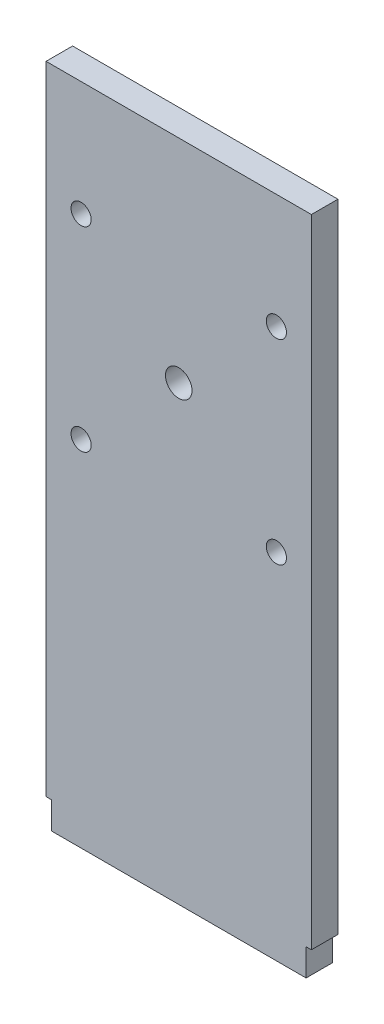
ISO-10303-21;
HEADER;
FILE_DESCRIPTION(('STEP AP214'),'2;1');
FILE_NAME('part.step','',(''),(''),'','','');
FILE_SCHEMA(('AUTOMOTIVE_DESIGN { 1 0 10303 214 1 1 1 1 }'));
ENDSEC;
DATA;
#1=APPLICATION_CONTEXT('core data for automotive mechanical design processes');
#2=APPLICATION_PROTOCOL_DEFINITION('international standard','automotive_design',2000,#1);
#3=PRODUCT_CONTEXT('',#1,'mechanical');
#4=PRODUCT('Part','Part','',(#3));
#5=PRODUCT_RELATED_PRODUCT_CATEGORY('part','',(#4));
#6=PRODUCT_DEFINITION_FORMATION('','',#4);
#7=PRODUCT_DEFINITION_CONTEXT('part definition',#1,'design');
#8=PRODUCT_DEFINITION('design','',#6,#7);
#9=PRODUCT_DEFINITION_SHAPE('','',#8);
#10=(LENGTH_UNIT() NAMED_UNIT(*) SI_UNIT(.MILLI.,.METRE.));
#11=(NAMED_UNIT(*) PLANE_ANGLE_UNIT() SI_UNIT($,.RADIAN.));
#12=(NAMED_UNIT(*) SI_UNIT($,.STERADIAN.) SOLID_ANGLE_UNIT());
#13=UNCERTAINTY_MEASURE_WITH_UNIT(LENGTH_MEASURE(1.E-05),#10,'distance_accuracy_value','');
#14=(GEOMETRIC_REPRESENTATION_CONTEXT(3) GLOBAL_UNCERTAINTY_ASSIGNED_CONTEXT((#13)) GLOBAL_UNIT_ASSIGNED_CONTEXT((#10,
#11,#12)) REPRESENTATION_CONTEXT('',''));
#15=CARTESIAN_POINT('',(0.,0.,0.));
#16=DIRECTION('',(0.,0.,1.));
#17=DIRECTION('',(1.,0.,0.));
#18=AXIS2_PLACEMENT_3D('',#15,#16,#17);
#19=CARTESIAN_POINT('',(0.,0.,6.35));
#20=DIRECTION('',(0.,0.,-1.));
#21=DIRECTION('',(-1.,0.,0.));
#22=AXIS2_PLACEMENT_3D('',#19,#20,#21);
#23=PLANE('',#22);
#24=CARTESIAN_POINT('',(8.38200000000009,84.7090000000001,6.35));
#25=DIRECTION('',(0.,0.,1.));
#26=DIRECTION('',(-1.,0.,0.));
#27=AXIS2_PLACEMENT_3D('',#24,#25,#26);
#28=CIRCLE('',#27,2.413);
#29=CARTESIAN_POINT('',(5.96900000000009,84.7090000000001,6.35));
#30=VERTEX_POINT('',#29);
#31=EDGE_CURVE('E148',#30,#30,#28,.T.);
#32=ORIENTED_EDGE('',*,*,#31,.F.);
#33=EDGE_LOOP('',(#32));
#34=FACE_BOUND('',#33,.T.);
#35=CARTESIAN_POINT('',(55.1179999999999,131.445,6.35));
#36=DIRECTION('',(0.,0.,1.));
#37=DIRECTION('',(-1.,0.,0.));
#38=AXIS2_PLACEMENT_3D('',#35,#36,#37);
#39=CIRCLE('',#38,2.41300000000001);
#40=CARTESIAN_POINT('',(52.7049999999999,131.445,6.35));
#41=VERTEX_POINT('',#40);
#42=EDGE_CURVE('E160',#41,#41,#39,.T.);
#43=ORIENTED_EDGE('',*,*,#42,.F.);
#44=EDGE_LOOP('',(#43));
#45=FACE_BOUND('',#44,.T.);
#46=DIRECTION('',(1.,0.,0.));
#47=VECTOR('',#46,1.);
#48=CARTESIAN_POINT('',(0.,0.,6.35));
#49=LINE('',#48,#47);
#50=CARTESIAN_POINT('',(1.27000000000001,0.,6.35));
#51=VERTEX_POINT('',#50);
#52=CARTESIAN_POINT('',(62.23,0.,6.35));
#53=VERTEX_POINT('',#52);
#54=EDGE_CURVE('E175',#51,#53,#49,.T.);
#55=ORIENTED_EDGE('',*,*,#54,.T.);
#56=DIRECTION('',(0.,-1.,0.));
#57=VECTOR('',#56,1.);
#58=CARTESIAN_POINT('',(62.23,0.,6.35));
#59=LINE('',#58,#57);
#60=CARTESIAN_POINT('',(62.23,6.477,6.35));
#61=VERTEX_POINT('',#60);
#62=EDGE_CURVE('E118',#61,#53,#59,.T.);
#63=ORIENTED_EDGE('',*,*,#62,.F.);
#64=DIRECTION('',(-1.,0.,0.));
#65=VECTOR('',#64,1.);
#66=CARTESIAN_POINT('',(63.5,6.477,6.35));
#67=LINE('',#66,#65);
#68=CARTESIAN_POINT('',(63.5,6.477,6.35));
#69=VERTEX_POINT('',#68);
#70=EDGE_CURVE('E99',#69,#61,#67,.T.);
#71=ORIENTED_EDGE('',*,*,#70,.F.);
#72=DIRECTION('',(0.,1.,0.));
#73=VECTOR('',#72,1.);
#74=CARTESIAN_POINT('',(63.5,0.,6.35));
#75=LINE('',#74,#73);
#76=CARTESIAN_POINT('',(63.5,158.877,6.35));
#77=VERTEX_POINT('',#76);
#78=EDGE_CURVE('E179',#69,#77,#75,.T.);
#79=ORIENTED_EDGE('',*,*,#78,.T.);
#80=DIRECTION('',(-1.,0.,0.));
#81=VECTOR('',#80,1.);
#82=CARTESIAN_POINT('',(0.,158.877,6.35));
#83=LINE('',#82,#81);
#84=CARTESIAN_POINT('',(0.,158.877,6.35));
#85=VERTEX_POINT('',#84);
#86=EDGE_CURVE('E181',#77,#85,#83,.T.);
#87=ORIENTED_EDGE('',*,*,#86,.T.);
#88=DIRECTION('',(0.,-1.,0.));
#89=VECTOR('',#88,1.);
#90=CARTESIAN_POINT('',(0.,0.,6.35));
#91=LINE('',#90,#89);
#92=CARTESIAN_POINT('',(0.,6.477,6.35));
#93=VERTEX_POINT('',#92);
#94=EDGE_CURVE('E172',#85,#93,#91,.T.);
#95=ORIENTED_EDGE('',*,*,#94,.T.);
#96=DIRECTION('',(-1.,0.,0.));
#97=VECTOR('',#96,1.);
#98=CARTESIAN_POINT('',(0.,6.477,6.35));
#99=LINE('',#98,#97);
#100=CARTESIAN_POINT('',(1.27000000000001,6.477,6.35));
#101=VERTEX_POINT('',#100);
#102=EDGE_CURVE('E128',#101,#93,#99,.T.);
#103=ORIENTED_EDGE('',*,*,#102,.F.);
#104=DIRECTION('',(0.,1.,0.));
#105=VECTOR('',#104,1.);
#106=CARTESIAN_POINT('',(1.27000000000001,0.,6.35));
#107=LINE('',#106,#105);
#108=EDGE_CURVE('E123',#51,#101,#107,.T.);
#109=ORIENTED_EDGE('',*,*,#108,.F.);
#110=EDGE_LOOP('',(#55,#63,#71,#79,#87,#95,#103,#109));
#111=FACE_BOUND('',#110,.T.);
#112=CARTESIAN_POINT('',(8.38200000000008,131.445,6.35));
#113=DIRECTION('',(0.,0.,1.));
#114=DIRECTION('',(1.,0.,0.));
#115=AXIS2_PLACEMENT_3D('',#112,#113,#114);
#116=CIRCLE('',#115,2.41300000000002);
#117=CARTESIAN_POINT('',(10.7950000000001,131.445,6.35));
#118=VERTEX_POINT('',#117);
#119=EDGE_CURVE('E166',#118,#118,#116,.T.);
#120=ORIENTED_EDGE('',*,*,#119,.F.);
#121=EDGE_LOOP('',(#120));
#122=FACE_BOUND('',#121,.T.);
#123=CARTESIAN_POINT('',(55.1179999999999,84.7090000000001,6.35));
#124=DIRECTION('',(0.,0.,1.));
#125=DIRECTION('',(1.,0.,0.));
#126=AXIS2_PLACEMENT_3D('',#123,#124,#125);
#127=CIRCLE('',#126,2.41299999999999);
#128=CARTESIAN_POINT('',(57.5309999999999,84.7090000000001,6.35));
#129=VERTEX_POINT('',#128);
#130=EDGE_CURVE('E154',#129,#129,#127,.T.);
#131=ORIENTED_EDGE('',*,*,#130,.F.);
#132=EDGE_LOOP('',(#131));
#133=FACE_BOUND('',#132,.T.);
#134=CARTESIAN_POINT('',(31.75,108.077,6.35));
#135=DIRECTION('',(0.,0.,1.));
#136=DIRECTION('',(1.,0.,0.));
#137=AXIS2_PLACEMENT_3D('',#134,#135,#136);
#138=CIRCLE('',#137,3.175);
#139=CARTESIAN_POINT('',(34.925,108.077,6.35));
#140=VERTEX_POINT('',#139);
#141=EDGE_CURVE('E142',#140,#140,#138,.T.);
#142=ORIENTED_EDGE('',*,*,#141,.F.);
#143=EDGE_LOOP('',(#142));
#144=FACE_BOUND('',#143,.T.);
#145=ADVANCED_FACE('F32',(#34,#45,#111,#122,#133,#144),#23,.F.);
#146=CARTESIAN_POINT('',(0.,0.,0.));
#147=DIRECTION('',(0.,0.,-1.));
#148=DIRECTION('',(-1.,0.,0.));
#149=AXIS2_PLACEMENT_3D('',#146,#147,#148);
#150=PLANE('',#149);
#151=DIRECTION('',(0.,-1.,0.));
#152=VECTOR('',#151,1.);
#153=CARTESIAN_POINT('',(62.23,0.,0.));
#154=LINE('',#153,#152);
#155=CARTESIAN_POINT('',(62.23,6.477,0.));
#156=VERTEX_POINT('',#155);
#157=CARTESIAN_POINT('',(62.23,0.,0.));
#158=VERTEX_POINT('',#157);
#159=EDGE_CURVE('E106',#156,#158,#154,.T.);
#160=ORIENTED_EDGE('',*,*,#159,.T.);
#161=DIRECTION('',(1.,0.,0.));
#162=VECTOR('',#161,1.);
#163=CARTESIAN_POINT('',(0.,0.,0.));
#164=LINE('',#163,#162);
#165=CARTESIAN_POINT('',(1.27000000000001,0.,0.));
#166=VERTEX_POINT('',#165);
#167=EDGE_CURVE('E185',#166,#158,#164,.T.);
#168=ORIENTED_EDGE('',*,*,#167,.F.);
#169=DIRECTION('',(0.,1.,0.));
#170=VECTOR('',#169,1.);
#171=CARTESIAN_POINT('',(1.27000000000001,0.,0.));
#172=LINE('',#171,#170);
#173=CARTESIAN_POINT('',(1.27000000000001,6.477,0.));
#174=VERTEX_POINT('',#173);
#175=EDGE_CURVE('E55',#166,#174,#172,.T.);
#176=ORIENTED_EDGE('',*,*,#175,.T.);
#177=DIRECTION('',(-1.,0.,0.));
#178=VECTOR('',#177,1.);
#179=CARTESIAN_POINT('',(0.,6.477,0.));
#180=LINE('',#179,#178);
#181=CARTESIAN_POINT('',(0.,6.477,0.));
#182=VERTEX_POINT('',#181);
#183=EDGE_CURVE('E127',#174,#182,#180,.T.);
#184=ORIENTED_EDGE('',*,*,#183,.T.);
#185=DIRECTION('',(0.,-1.,0.));
#186=VECTOR('',#185,1.);
#187=CARTESIAN_POINT('',(0.,0.,0.));
#188=LINE('',#187,#186);
#189=CARTESIAN_POINT('',(0.,158.877,0.));
#190=VERTEX_POINT('',#189);
#191=EDGE_CURVE('E169',#190,#182,#188,.T.);
#192=ORIENTED_EDGE('',*,*,#191,.F.);
#193=DIRECTION('',(-1.,0.,0.));
#194=VECTOR('',#193,1.);
#195=CARTESIAN_POINT('',(0.,158.877,0.));
#196=LINE('',#195,#194);
#197=CARTESIAN_POINT('',(63.5,158.877,0.));
#198=VERTEX_POINT('',#197);
#199=EDGE_CURVE('E176',#198,#190,#196,.T.);
#200=ORIENTED_EDGE('',*,*,#199,.F.);
#201=DIRECTION('',(0.,1.,0.));
#202=VECTOR('',#201,1.);
#203=CARTESIAN_POINT('',(63.5,0.,0.));
#204=LINE('',#203,#202);
#205=CARTESIAN_POINT('',(63.5,6.477,0.));
#206=VERTEX_POINT('',#205);
#207=EDGE_CURVE('E117',#206,#198,#204,.T.);
#208=ORIENTED_EDGE('',*,*,#207,.F.);
#209=DIRECTION('',(-1.,0.,0.));
#210=VECTOR('',#209,1.);
#211=CARTESIAN_POINT('',(63.5,6.477,0.));
#212=LINE('',#211,#210);
#213=EDGE_CURVE('E47',#206,#156,#212,.T.);
#214=ORIENTED_EDGE('',*,*,#213,.T.);
#215=EDGE_LOOP('',(#160,#168,#176,#184,#192,#200,#208,#214));
#216=FACE_BOUND('',#215,.T.);
#217=CARTESIAN_POINT('',(8.38200000000009,84.7090000000001,0.));
#218=DIRECTION('',(0.,0.,1.));
#219=DIRECTION('',(-1.,0.,0.));
#220=AXIS2_PLACEMENT_3D('',#217,#218,#219);
#221=CIRCLE('',#220,2.413);
#222=CARTESIAN_POINT('',(5.96900000000009,84.7090000000001,0.));
#223=VERTEX_POINT('',#222);
#224=EDGE_CURVE('E145',#223,#223,#221,.T.);
#225=ORIENTED_EDGE('',*,*,#224,.T.);
#226=EDGE_LOOP('',(#225));
#227=FACE_BOUND('',#226,.T.);
#228=CARTESIAN_POINT('',(55.1179999999999,131.445,0.));
#229=DIRECTION('',(0.,0.,1.));
#230=DIRECTION('',(-1.,0.,0.));
#231=AXIS2_PLACEMENT_3D('',#228,#229,#230);
#232=CIRCLE('',#231,2.41300000000001);
#233=CARTESIAN_POINT('',(52.7049999999999,131.445,0.));
#234=VERTEX_POINT('',#233);
#235=EDGE_CURVE('E157',#234,#234,#232,.T.);
#236=ORIENTED_EDGE('',*,*,#235,.T.);
#237=EDGE_LOOP('',(#236));
#238=FACE_BOUND('',#237,.T.);
#239=CARTESIAN_POINT('',(8.38200000000008,131.445,0.));
#240=DIRECTION('',(0.,0.,1.));
#241=DIRECTION('',(1.,0.,0.));
#242=AXIS2_PLACEMENT_3D('',#239,#240,#241);
#243=CIRCLE('',#242,2.41300000000002);
#244=CARTESIAN_POINT('',(10.7950000000001,131.445,0.));
#245=VERTEX_POINT('',#244);
#246=EDGE_CURVE('E163',#245,#245,#243,.T.);
#247=ORIENTED_EDGE('',*,*,#246,.T.);
#248=EDGE_LOOP('',(#247));
#249=FACE_BOUND('',#248,.T.);
#250=CARTESIAN_POINT('',(55.1179999999999,84.7090000000001,0.));
#251=DIRECTION('',(0.,0.,1.));
#252=DIRECTION('',(1.,0.,0.));
#253=AXIS2_PLACEMENT_3D('',#250,#251,#252);
#254=CIRCLE('',#253,2.41299999999999);
#255=CARTESIAN_POINT('',(57.5309999999999,84.7090000000001,0.));
#256=VERTEX_POINT('',#255);
#257=EDGE_CURVE('E151',#256,#256,#254,.T.);
#258=ORIENTED_EDGE('',*,*,#257,.T.);
#259=EDGE_LOOP('',(#258));
#260=FACE_BOUND('',#259,.T.);
#261=CARTESIAN_POINT('',(31.75,108.077,0.));
#262=DIRECTION('',(0.,0.,1.));
#263=DIRECTION('',(1.,0.,0.));
#264=AXIS2_PLACEMENT_3D('',#261,#262,#263);
#265=CIRCLE('',#264,3.175);
#266=CARTESIAN_POINT('',(34.925,108.077,0.));
#267=VERTEX_POINT('',#266);
#268=EDGE_CURVE('E138',#267,#267,#265,.T.);
#269=ORIENTED_EDGE('',*,*,#268,.T.);
#270=EDGE_LOOP('',(#269));
#271=FACE_BOUND('',#270,.T.);
#272=ADVANCED_FACE('F114',(#216,#227,#238,#249,#260,#271),#150,.T.);
#273=CARTESIAN_POINT('',(0.,0.,6.35));
#274=DIRECTION('',(1.,0.,0.));
#275=DIRECTION('',(0.,0.,-1.));
#276=AXIS2_PLACEMENT_3D('',#273,#274,#275);
#277=PLANE('',#276);
#278=ORIENTED_EDGE('',*,*,#191,.T.);
#279=DIRECTION('',(0.,0.,1.));
#280=VECTOR('',#279,1.);
#281=CARTESIAN_POINT('',(0.,6.477,0.));
#282=LINE('',#281,#280);
#283=EDGE_CURVE('E135',#182,#93,#282,.T.);
#284=ORIENTED_EDGE('',*,*,#283,.T.);
#285=ORIENTED_EDGE('',*,*,#94,.F.);
#286=DIRECTION('',(0.,0.,-1.));
#287=VECTOR('',#286,1.);
#288=CARTESIAN_POINT('',(0.,158.877,6.35));
#289=LINE('',#288,#287);
#290=EDGE_CURVE('E40',#85,#190,#289,.T.);
#291=ORIENTED_EDGE('',*,*,#290,.T.);
#292=EDGE_LOOP('',(#278,#284,#285,#291));
#293=FACE_BOUND('',#292,.T.);
#294=ADVANCED_FACE('F34',(#293),#277,.F.);
#295=CARTESIAN_POINT('',(0.,0.,6.35));
#296=DIRECTION('',(0.,1.,0.));
#297=DIRECTION('',(0.,0.,1.));
#298=AXIS2_PLACEMENT_3D('',#295,#296,#297);
#299=PLANE('',#298);
#300=ORIENTED_EDGE('',*,*,#167,.T.);
#301=DIRECTION('',(0.,0.,1.));
#302=VECTOR('',#301,1.);
#303=CARTESIAN_POINT('',(62.23,0.,0.));
#304=LINE('',#303,#302);
#305=EDGE_CURVE('E102',#158,#53,#304,.T.);
#306=ORIENTED_EDGE('',*,*,#305,.T.);
#307=ORIENTED_EDGE('',*,*,#54,.F.);
#308=DIRECTION('',(0.,0.,1.));
#309=VECTOR('',#308,1.);
#310=CARTESIAN_POINT('',(1.27000000000001,0.,0.));
#311=LINE('',#310,#309);
#312=EDGE_CURVE('E131',#166,#51,#311,.T.);
#313=ORIENTED_EDGE('',*,*,#312,.F.);
#314=EDGE_LOOP('',(#300,#306,#307,#313));
#315=FACE_BOUND('',#314,.T.);
#316=ADVANCED_FACE('F209',(#315),#299,.F.);
#317=CARTESIAN_POINT('',(63.5,0.,6.35));
#318=DIRECTION('',(-1.,0.,0.));
#319=DIRECTION('',(0.,-1.,0.));
#320=AXIS2_PLACEMENT_3D('',#317,#318,#319);
#321=PLANE('',#320);
#322=ORIENTED_EDGE('',*,*,#78,.F.);
#323=DIRECTION('',(0.,0.,1.));
#324=VECTOR('',#323,1.);
#325=CARTESIAN_POINT('',(63.5,6.477,0.));
#326=LINE('',#325,#324);
#327=EDGE_CURVE('E103',#206,#69,#326,.T.);
#328=ORIENTED_EDGE('',*,*,#327,.F.);
#329=ORIENTED_EDGE('',*,*,#207,.T.);
#330=DIRECTION('',(0.,0.,-1.));
#331=VECTOR('',#330,1.);
#332=CARTESIAN_POINT('',(63.5,158.877,6.35));
#333=LINE('',#332,#331);
#334=EDGE_CURVE('E11',#77,#198,#333,.T.);
#335=ORIENTED_EDGE('',*,*,#334,.F.);
#336=EDGE_LOOP('',(#322,#328,#329,#335));
#337=FACE_BOUND('',#336,.T.);
#338=ADVANCED_FACE('F206',(#337),#321,.F.);
#339=CARTESIAN_POINT('',(0.,158.877,6.35));
#340=DIRECTION('',(0.,-1.,0.));
#341=DIRECTION('',(0.,0.,-1.));
#342=AXIS2_PLACEMENT_3D('',#339,#340,#341);
#343=PLANE('',#342);
#344=ORIENTED_EDGE('',*,*,#199,.T.);
#345=ORIENTED_EDGE('',*,*,#290,.F.);
#346=ORIENTED_EDGE('',*,*,#86,.F.);
#347=ORIENTED_EDGE('',*,*,#334,.T.);
#348=EDGE_LOOP('',(#344,#345,#346,#347));
#349=FACE_BOUND('',#348,.T.);
#350=ADVANCED_FACE('F204',(#349),#343,.F.);
#351=CARTESIAN_POINT('',(8.38200000000008,131.445,6.35));
#352=DIRECTION('',(0.,0.,-1.));
#353=DIRECTION('',(-1.,0.,0.));
#354=AXIS2_PLACEMENT_3D('',#351,#352,#353);
#355=CYLINDRICAL_SURFACE('',#354,2.41300000000002);
#356=ORIENTED_EDGE('',*,*,#119,.T.);
#357=EDGE_LOOP('',(#356));
#358=FACE_BOUND('',#357,.T.);
#359=ORIENTED_EDGE('',*,*,#246,.F.);
#360=EDGE_LOOP('',(#359));
#361=FACE_BOUND('',#360,.T.);
#362=ADVANCED_FACE('F231',(#358,#361),#355,.F.);
#363=CARTESIAN_POINT('',(55.1179999999999,131.445,6.35));
#364=DIRECTION('',(0.,0.,-1.));
#365=DIRECTION('',(-1.,0.,0.));
#366=AXIS2_PLACEMENT_3D('',#363,#364,#365);
#367=CYLINDRICAL_SURFACE('',#366,2.41300000000001);
#368=ORIENTED_EDGE('',*,*,#42,.T.);
#369=EDGE_LOOP('',(#368));
#370=FACE_BOUND('',#369,.T.);
#371=ORIENTED_EDGE('',*,*,#235,.F.);
#372=EDGE_LOOP('',(#371));
#373=FACE_BOUND('',#372,.T.);
#374=ADVANCED_FACE('F280',(#370,#373),#367,.F.);
#375=CARTESIAN_POINT('',(55.1179999999999,84.7090000000001,6.35));
#376=DIRECTION('',(0.,0.,-1.));
#377=DIRECTION('',(-1.,0.,0.));
#378=AXIS2_PLACEMENT_3D('',#375,#376,#377);
#379=CYLINDRICAL_SURFACE('',#378,2.41299999999999);
#380=ORIENTED_EDGE('',*,*,#130,.T.);
#381=EDGE_LOOP('',(#380));
#382=FACE_BOUND('',#381,.T.);
#383=ORIENTED_EDGE('',*,*,#257,.F.);
#384=EDGE_LOOP('',(#383));
#385=FACE_BOUND('',#384,.T.);
#386=ADVANCED_FACE('F270',(#382,#385),#379,.F.);
#387=CARTESIAN_POINT('',(8.38200000000009,84.7090000000001,6.35));
#388=DIRECTION('',(0.,0.,-1.));
#389=DIRECTION('',(-1.,0.,0.));
#390=AXIS2_PLACEMENT_3D('',#387,#388,#389);
#391=CYLINDRICAL_SURFACE('',#390,2.413);
#392=ORIENTED_EDGE('',*,*,#31,.T.);
#393=EDGE_LOOP('',(#392));
#394=FACE_BOUND('',#393,.T.);
#395=ORIENTED_EDGE('',*,*,#224,.F.);
#396=EDGE_LOOP('',(#395));
#397=FACE_BOUND('',#396,.T.);
#398=ADVANCED_FACE('F260',(#394,#397),#391,.F.);
#399=CARTESIAN_POINT('',(31.75,108.077,6.35));
#400=DIRECTION('',(0.,0.,-1.));
#401=DIRECTION('',(-1.,0.,0.));
#402=AXIS2_PLACEMENT_3D('',#399,#400,#401);
#403=CYLINDRICAL_SURFACE('',#402,3.175);
#404=ORIENTED_EDGE('',*,*,#141,.T.);
#405=EDGE_LOOP('',(#404));
#406=FACE_BOUND('',#405,.T.);
#407=ORIENTED_EDGE('',*,*,#268,.F.);
#408=EDGE_LOOP('',(#407));
#409=FACE_BOUND('',#408,.T.);
#410=ADVANCED_FACE('F218',(#406,#409),#403,.F.);
#411=CARTESIAN_POINT('',(0.,6.477,0.));
#412=DIRECTION('',(0.,1.,0.));
#413=DIRECTION('',(-1.,0.,0.));
#414=AXIS2_PLACEMENT_3D('',#411,#412,#413);
#415=PLANE('',#414);
#416=ORIENTED_EDGE('',*,*,#102,.T.);
#417=ORIENTED_EDGE('',*,*,#283,.F.);
#418=ORIENTED_EDGE('',*,*,#183,.F.);
#419=DIRECTION('',(0.,0.,1.));
#420=VECTOR('',#419,1.);
#421=CARTESIAN_POINT('',(1.27000000000001,6.477,0.));
#422=LINE('',#421,#420);
#423=EDGE_CURVE('E139',#174,#101,#422,.T.);
#424=ORIENTED_EDGE('',*,*,#423,.T.);
#425=EDGE_LOOP('',(#416,#417,#418,#424));
#426=FACE_BOUND('',#425,.T.);
#427=ADVANCED_FACE('F197',(#426),#415,.F.);
#428=CARTESIAN_POINT('',(1.27000000000001,0.,0.));
#429=DIRECTION('',(1.,0.,0.));
#430=DIRECTION('',(0.,1.,0.));
#431=AXIS2_PLACEMENT_3D('',#428,#429,#430);
#432=PLANE('',#431);
#433=ORIENTED_EDGE('',*,*,#108,.T.);
#434=ORIENTED_EDGE('',*,*,#423,.F.);
#435=ORIENTED_EDGE('',*,*,#175,.F.);
#436=ORIENTED_EDGE('',*,*,#312,.T.);
#437=EDGE_LOOP('',(#433,#434,#435,#436));
#438=FACE_BOUND('',#437,.T.);
#439=ADVANCED_FACE('F210',(#438),#432,.F.);
#440=CARTESIAN_POINT('',(62.23,0.,0.));
#441=DIRECTION('',(-1.,0.,0.));
#442=DIRECTION('',(0.,0.,1.));
#443=AXIS2_PLACEMENT_3D('',#440,#441,#442);
#444=PLANE('',#443);
#445=ORIENTED_EDGE('',*,*,#62,.T.);
#446=ORIENTED_EDGE('',*,*,#305,.F.);
#447=ORIENTED_EDGE('',*,*,#159,.F.);
#448=DIRECTION('',(0.,0.,1.));
#449=VECTOR('',#448,1.);
#450=CARTESIAN_POINT('',(62.23,6.477,0.));
#451=LINE('',#450,#449);
#452=EDGE_CURVE('E95',#156,#61,#451,.T.);
#453=ORIENTED_EDGE('',*,*,#452,.T.);
#454=EDGE_LOOP('',(#445,#446,#447,#453));
#455=FACE_BOUND('',#454,.T.);
#456=ADVANCED_FACE('F107',(#455),#444,.F.);
#457=CARTESIAN_POINT('',(63.5,6.477,0.));
#458=DIRECTION('',(0.,1.,0.));
#459=DIRECTION('',(-1.,0.,0.));
#460=AXIS2_PLACEMENT_3D('',#457,#458,#459);
#461=PLANE('',#460);
#462=ORIENTED_EDGE('',*,*,#70,.T.);
#463=ORIENTED_EDGE('',*,*,#452,.F.);
#464=ORIENTED_EDGE('',*,*,#213,.F.);
#465=ORIENTED_EDGE('',*,*,#327,.T.);
#466=EDGE_LOOP('',(#462,#463,#464,#465));
#467=FACE_BOUND('',#466,.T.);
#468=ADVANCED_FACE('F97',(#467),#461,.F.);
#469=CLOSED_SHELL('',(#145,#272,#294,#316,#338,#350,#362,#374,#386,#398,#410,#427,#439,#456,#468));
#470=MANIFOLD_SOLID_BREP('B2',#469);
#471=ADVANCED_BREP_SHAPE_REPRESENTATION('',(#18,#470),#14);
#472=SHAPE_DEFINITION_REPRESENTATION(#9,#471);
ENDSEC;
END-ISO-10303-21;
